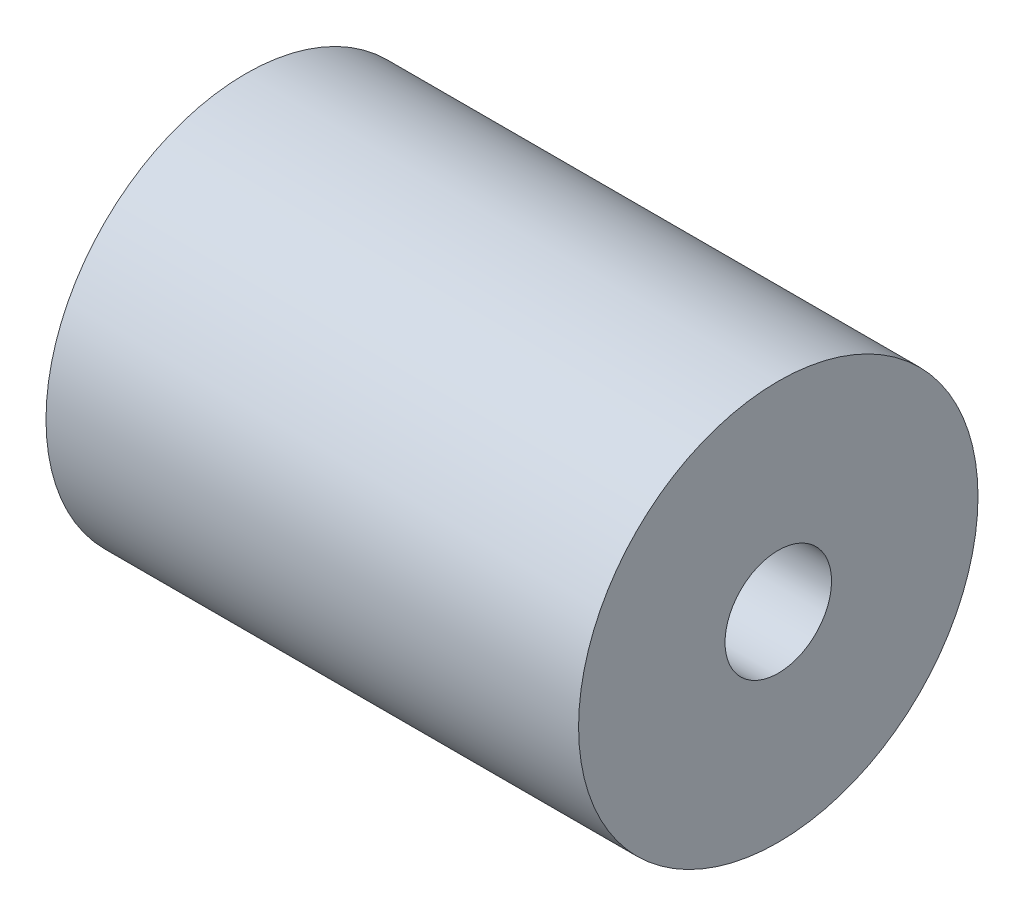
ISO-10303-21;
HEADER;
FILE_DESCRIPTION(('STEP AP214'),'2;1');
FILE_NAME('part.step','',(''),(''),'','','');
FILE_SCHEMA(('AUTOMOTIVE_DESIGN { 1 0 10303 214 1 1 1 1 }'));
ENDSEC;
DATA;
#1=APPLICATION_CONTEXT('core data for automotive mechanical design processes');
#2=APPLICATION_PROTOCOL_DEFINITION('international standard','automotive_design',2000,#1);
#3=PRODUCT_CONTEXT('',#1,'mechanical');
#4=PRODUCT('Part','Part','',(#3));
#5=PRODUCT_RELATED_PRODUCT_CATEGORY('part','',(#4));
#6=PRODUCT_DEFINITION_FORMATION('','',#4);
#7=PRODUCT_DEFINITION_CONTEXT('part definition',#1,'design');
#8=PRODUCT_DEFINITION('design','',#6,#7);
#9=PRODUCT_DEFINITION_SHAPE('','',#8);
#10=(LENGTH_UNIT() NAMED_UNIT(*) SI_UNIT(.MILLI.,.METRE.));
#11=(NAMED_UNIT(*) PLANE_ANGLE_UNIT() SI_UNIT($,.RADIAN.));
#12=(NAMED_UNIT(*) SI_UNIT($,.STERADIAN.) SOLID_ANGLE_UNIT());
#13=UNCERTAINTY_MEASURE_WITH_UNIT(LENGTH_MEASURE(1.E-05),#10,'distance_accuracy_value','');
#14=(GEOMETRIC_REPRESENTATION_CONTEXT(3) GLOBAL_UNCERTAINTY_ASSIGNED_CONTEXT((#13)) GLOBAL_UNIT_ASSIGNED_CONTEXT((#10,
#11,#12)) REPRESENTATION_CONTEXT('',''));
#15=CARTESIAN_POINT('',(0.,0.,0.));
#16=DIRECTION('',(0.,0.,1.));
#17=DIRECTION('',(1.,0.,0.));
#18=AXIS2_PLACEMENT_3D('',#15,#16,#17);
#19=CARTESIAN_POINT('',(20.,0.,0.));
#20=DIRECTION('',(1.,0.,0.));
#21=DIRECTION('',(0.,0.,-1.));
#22=AXIS2_PLACEMENT_3D('',#19,#20,#21);
#23=PLANE('',#22);
#24=CARTESIAN_POINT('',(20.,0.,0.));
#25=DIRECTION('',(1.,0.,0.));
#26=DIRECTION('',(0.,0.,-1.));
#27=AXIS2_PLACEMENT_3D('',#24,#25,#26);
#28=CIRCLE('',#27,7.5);
#29=CARTESIAN_POINT('',(20.,0.,-7.5));
#30=VERTEX_POINT('',#29);
#31=EDGE_CURVE('E10',#30,#30,#28,.T.);
#32=ORIENTED_EDGE('',*,*,#31,.T.);
#33=EDGE_LOOP('',(#32));
#34=FACE_BOUND('',#33,.T.);
#35=CARTESIAN_POINT('',(20.,0.,0.));
#36=DIRECTION('',(1.,0.,0.));
#37=DIRECTION('',(0.,0.,-1.));
#38=AXIS2_PLACEMENT_3D('',#35,#36,#37);
#39=CIRCLE('',#38,2.);
#40=CARTESIAN_POINT('',(20.,0.,-2.));
#41=VERTEX_POINT('',#40);
#42=EDGE_CURVE('E50',#41,#41,#39,.T.);
#43=ORIENTED_EDGE('',*,*,#42,.F.);
#44=EDGE_LOOP('',(#43));
#45=FACE_BOUND('',#44,.T.);
#46=ADVANCED_FACE('F37',(#34,#45),#23,.T.);
#47=CARTESIAN_POINT('',(0.,0.,0.));
#48=DIRECTION('',(1.,0.,0.));
#49=DIRECTION('',(0.,0.,-1.));
#50=AXIS2_PLACEMENT_3D('',#47,#48,#49);
#51=PLANE('',#50);
#52=CARTESIAN_POINT('',(0.,0.,0.));
#53=DIRECTION('',(1.,0.,0.));
#54=DIRECTION('',(0.,0.,-1.));
#55=AXIS2_PLACEMENT_3D('',#52,#53,#54);
#56=CIRCLE('',#55,7.5);
#57=CARTESIAN_POINT('',(0.,0.,-7.5));
#58=VERTEX_POINT('',#57);
#59=EDGE_CURVE('E41',#58,#58,#56,.T.);
#60=ORIENTED_EDGE('',*,*,#59,.F.);
#61=EDGE_LOOP('',(#60));
#62=FACE_BOUND('',#61,.T.);
#63=CARTESIAN_POINT('',(0.,0.,0.));
#64=DIRECTION('',(1.,0.,0.));
#65=DIRECTION('',(0.,0.,-1.));
#66=AXIS2_PLACEMENT_3D('',#63,#64,#65);
#67=CIRCLE('',#66,2.);
#68=CARTESIAN_POINT('',(0.,0.,-2.));
#69=VERTEX_POINT('',#68);
#70=EDGE_CURVE('E52',#69,#69,#67,.T.);
#71=ORIENTED_EDGE('',*,*,#70,.T.);
#72=EDGE_LOOP('',(#71));
#73=FACE_BOUND('',#72,.T.);
#74=ADVANCED_FACE('F64',(#62,#73),#51,.F.);
#75=CARTESIAN_POINT('',(20.,0.,0.));
#76=DIRECTION('',(-1.,0.,0.));
#77=DIRECTION('',(0.,0.,1.));
#78=AXIS2_PLACEMENT_3D('',#75,#76,#77);
#79=CYLINDRICAL_SURFACE('',#78,7.5);
#80=ORIENTED_EDGE('',*,*,#31,.F.);
#81=EDGE_LOOP('',(#80));
#82=FACE_BOUND('',#81,.T.);
#83=ORIENTED_EDGE('',*,*,#59,.T.);
#84=EDGE_LOOP('',(#83));
#85=FACE_BOUND('',#84,.T.);
#86=ADVANCED_FACE('F39',(#82,#85),#79,.T.);
#87=CARTESIAN_POINT('',(20.,0.,0.));
#88=DIRECTION('',(-1.,0.,0.));
#89=DIRECTION('',(0.,0.,1.));
#90=AXIS2_PLACEMENT_3D('',#87,#88,#89);
#91=CYLINDRICAL_SURFACE('',#90,2.);
#92=ORIENTED_EDGE('',*,*,#42,.T.);
#93=EDGE_LOOP('',(#92));
#94=FACE_BOUND('',#93,.T.);
#95=ORIENTED_EDGE('',*,*,#70,.F.);
#96=EDGE_LOOP('',(#95));
#97=FACE_BOUND('',#96,.T.);
#98=ADVANCED_FACE('F60',(#94,#97),#91,.F.);
#99=CLOSED_SHELL('',(#46,#74,#86,#98));
#100=MANIFOLD_SOLID_BREP('B2',#99);
#101=ADVANCED_BREP_SHAPE_REPRESENTATION('',(#18,#100),#14);
#102=SHAPE_DEFINITION_REPRESENTATION(#9,#101);
ENDSEC;
END-ISO-10303-21;
